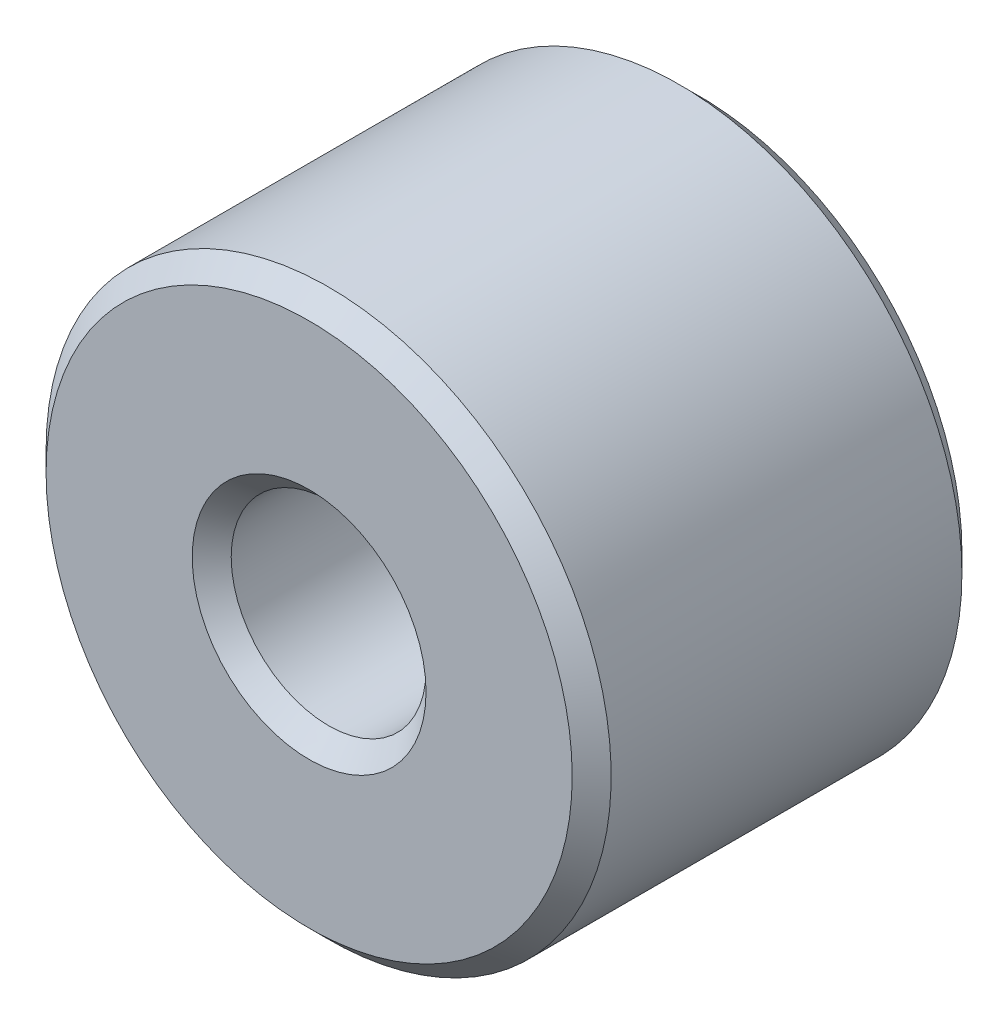
ISO-10303-21;
HEADER;
FILE_DESCRIPTION(('STEP AP214'),'2;1');
FILE_NAME('part.step','',(''),(''),'','','');
FILE_SCHEMA(('AUTOMOTIVE_DESIGN { 1 0 10303 214 1 1 1 1 }'));
ENDSEC;
DATA;
#1=APPLICATION_CONTEXT('core data for automotive mechanical design processes');
#2=APPLICATION_PROTOCOL_DEFINITION('international standard','automotive_design',2000,#1);
#3=PRODUCT_CONTEXT('',#1,'mechanical');
#4=PRODUCT('Part','Part','',(#3));
#5=PRODUCT_RELATED_PRODUCT_CATEGORY('part','',(#4));
#6=PRODUCT_DEFINITION_FORMATION('','',#4);
#7=PRODUCT_DEFINITION_CONTEXT('part definition',#1,'design');
#8=PRODUCT_DEFINITION('design','',#6,#7);
#9=PRODUCT_DEFINITION_SHAPE('','',#8);
#10=(LENGTH_UNIT() NAMED_UNIT(*) SI_UNIT(.MILLI.,.METRE.));
#11=(NAMED_UNIT(*) PLANE_ANGLE_UNIT() SI_UNIT($,.RADIAN.));
#12=(NAMED_UNIT(*) SI_UNIT($,.STERADIAN.) SOLID_ANGLE_UNIT());
#13=UNCERTAINTY_MEASURE_WITH_UNIT(LENGTH_MEASURE(1.E-05),#10,'distance_accuracy_value','');
#14=(GEOMETRIC_REPRESENTATION_CONTEXT(3) GLOBAL_UNCERTAINTY_ASSIGNED_CONTEXT((#13)) GLOBAL_UNIT_ASSIGNED_CONTEXT((#10,
#11,#12)) REPRESENTATION_CONTEXT('',''));
#15=CARTESIAN_POINT('',(0.,0.,0.));
#16=DIRECTION('',(0.,0.,1.));
#17=DIRECTION('',(1.,0.,0.));
#18=AXIS2_PLACEMENT_3D('',#15,#16,#17);
#19=CARTESIAN_POINT('',(0.,0.,10.));
#20=DIRECTION('',(0.,0.,-1.));
#21=DIRECTION('',(-1.,0.,0.));
#22=AXIS2_PLACEMENT_3D('',#19,#20,#21);
#23=CYLINDRICAL_SURFACE('',#22,2.5);
#24=CARTESIAN_POINT('',(0.,0.,0.499999999988177));
#25=DIRECTION('',(0.,0.,-1.));
#26=DIRECTION('',(-1.,0.,0.));
#27=AXIS2_PLACEMENT_3D('',#24,#25,#26);
#28=CIRCLE('',#27,2.49999999999773);
#29=CARTESIAN_POINT('',(-2.49999999999773,0.,0.499999999988177));
#30=VERTEX_POINT('',#29);
#31=EDGE_CURVE('E30',#30,#30,#28,.T.);
#32=ORIENTED_EDGE('',*,*,#31,.T.);
#33=EDGE_LOOP('',(#32));
#34=FACE_BOUND('',#33,.T.);
#35=CARTESIAN_POINT('',(0.,0.,9.50000000000273));
#36=DIRECTION('',(0.,0.,1.));
#37=DIRECTION('',(1.,0.,0.));
#38=AXIS2_PLACEMENT_3D('',#35,#36,#37);
#39=CIRCLE('',#38,2.49999999994088);
#40=CARTESIAN_POINT('',(2.49999999994088,0.,9.50000000000273));
#41=VERTEX_POINT('',#40);
#42=EDGE_CURVE('E33',#41,#41,#39,.T.);
#43=ORIENTED_EDGE('',*,*,#42,.T.);
#44=EDGE_LOOP('',(#43));
#45=FACE_BOUND('',#44,.T.);
#46=ADVANCED_FACE('F15',(#34,#45),#23,.F.);
#47=CARTESIAN_POINT('',(0.,0.,9.99999999999091));
#48=DIRECTION('',(0.,0.,1.));
#49=DIRECTION('',(1.,0.,0.));
#50=AXIS2_PLACEMENT_3D('',#47,#48,#49);
#51=CONICAL_SURFACE('',#50,2.9999999999859,0.785398163454292);
#52=ORIENTED_EDGE('',*,*,#42,.F.);
#53=EDGE_LOOP('',(#52));
#54=FACE_BOUND('',#53,.T.);
#55=CARTESIAN_POINT('',(0.,0.,9.99999999999091));
#56=DIRECTION('',(0.,0.,1.));
#57=DIRECTION('',(1.,0.,0.));
#58=AXIS2_PLACEMENT_3D('',#55,#56,#57);
#59=CIRCLE('',#58,2.9999999999859);
#60=CARTESIAN_POINT('',(2.9999999999859,0.,9.99999999999091));
#61=VERTEX_POINT('',#60);
#62=EDGE_CURVE('E18',#61,#61,#59,.F.);
#63=ORIENTED_EDGE('',*,*,#62,.F.);
#64=EDGE_LOOP('',(#63));
#65=FACE_BOUND('',#64,.T.);
#66=ADVANCED_FACE('F49',(#54,#65),#51,.F.);
#67=CARTESIAN_POINT('',(0.,0.,5.6843418860808E-11));
#68=DIRECTION('',(0.,0.,-1.));
#69=DIRECTION('',(-1.,0.,0.));
#70=AXIS2_PLACEMENT_3D('',#67,#68,#69);
#71=CONICAL_SURFACE('',#70,2.99999999992906,0.785398163397448);
#72=CARTESIAN_POINT('',(0.,0.,0.));
#73=DIRECTION('',(0.,0.,-1.));
#74=DIRECTION('',(-1.,0.,0.));
#75=AXIS2_PLACEMENT_3D('',#72,#73,#74);
#76=CIRCLE('',#75,2.9999999999859);
#77=CARTESIAN_POINT('',(-2.9999999999859,0.,0.));
#78=VERTEX_POINT('',#77);
#79=EDGE_CURVE('E40',#78,#78,#76,.T.);
#80=ORIENTED_EDGE('',*,*,#79,.T.);
#81=EDGE_LOOP('',(#80));
#82=FACE_BOUND('',#81,.T.);
#83=ORIENTED_EDGE('',*,*,#31,.F.);
#84=EDGE_LOOP('',(#83));
#85=FACE_BOUND('',#84,.T.);
#86=ADVANCED_FACE('F51',(#82,#85),#71,.F.);
#87=CARTESIAN_POINT('',(0.,0.,10.));
#88=DIRECTION('',(0.,0.,1.));
#89=DIRECTION('',(1.,0.,0.));
#90=AXIS2_PLACEMENT_3D('',#87,#88,#89);
#91=PLANE('',#90);
#92=CARTESIAN_POINT('',(0.,0.,9.99999999999091));
#93=DIRECTION('',(0.,0.,-1.));
#94=DIRECTION('',(-1.,0.,0.));
#95=AXIS2_PLACEMENT_3D('',#92,#93,#94);
#96=CIRCLE('',#95,6.75000000006776);
#97=CARTESIAN_POINT('',(-6.75000000006776,0.,9.99999999999091));
#98=VERTEX_POINT('',#97);
#99=EDGE_CURVE('E38',#98,#98,#96,.T.);
#100=ORIENTED_EDGE('',*,*,#99,.F.);
#101=EDGE_LOOP('',(#100));
#102=FACE_BOUND('',#101,.T.);
#103=ORIENTED_EDGE('',*,*,#62,.T.);
#104=EDGE_LOOP('',(#103));
#105=FACE_BOUND('',#104,.T.);
#106=ADVANCED_FACE('F47',(#102,#105),#91,.T.);
#107=CARTESIAN_POINT('',(0.,0.,0.));
#108=DIRECTION('',(0.,0.,1.));
#109=DIRECTION('',(1.,0.,0.));
#110=AXIS2_PLACEMENT_3D('',#107,#108,#109);
#111=PLANE('',#110);
#112=CARTESIAN_POINT('',(0.,0.,0.));
#113=DIRECTION('',(0.,0.,1.));
#114=DIRECTION('',(1.,0.,0.));
#115=AXIS2_PLACEMENT_3D('',#112,#113,#114);
#116=CIRCLE('',#115,6.75);
#117=CARTESIAN_POINT('',(6.75,0.,0.));
#118=VERTEX_POINT('',#117);
#119=EDGE_CURVE('E27',#118,#118,#116,.T.);
#120=ORIENTED_EDGE('',*,*,#119,.F.);
#121=EDGE_LOOP('',(#120));
#122=FACE_BOUND('',#121,.T.);
#123=ORIENTED_EDGE('',*,*,#79,.F.);
#124=EDGE_LOOP('',(#123));
#125=FACE_BOUND('',#124,.T.);
#126=ADVANCED_FACE('F75',(#122,#125),#111,.F.);
#127=CARTESIAN_POINT('',(0.,0.,9.50000000011642));
#128=DIRECTION('',(0.,0.,-1.));
#129=DIRECTION('',(-1.,0.,0.));
#130=AXIS2_PLACEMENT_3D('',#127,#128,#129);
#131=CONICAL_SURFACE('',#130,7.24999999994225,0.785398163397448);
#132=CARTESIAN_POINT('',(0.,0.,9.49999999999999));
#133=DIRECTION('',(0.,0.,-1.));
#134=DIRECTION('',(-1.,0.,0.));
#135=AXIS2_PLACEMENT_3D('',#132,#133,#134);
#136=CIRCLE('',#135,7.25);
#137=CARTESIAN_POINT('',(-7.25,0.,9.49999999999999));
#138=VERTEX_POINT('',#137);
#139=EDGE_CURVE('E22',#138,#138,#136,.T.);
#140=ORIENTED_EDGE('',*,*,#139,.F.);
#141=EDGE_LOOP('',(#140));
#142=FACE_BOUND('',#141,.T.);
#143=ORIENTED_EDGE('',*,*,#99,.T.);
#144=EDGE_LOOP('',(#143));
#145=FACE_BOUND('',#144,.T.);
#146=ADVANCED_FACE('F68',(#142,#145),#131,.T.);
#147=CARTESIAN_POINT('',(0.,0.,0.500000000000003));
#148=DIRECTION('',(0.,0.,1.));
#149=DIRECTION('',(1.,0.,0.));
#150=AXIS2_PLACEMENT_3D('',#147,#148,#149);
#151=CONICAL_SURFACE('',#150,7.25,0.78539816339745);
#152=CARTESIAN_POINT('',(0.,0.,0.500000000000002));
#153=DIRECTION('',(0.,0.,-1.));
#154=DIRECTION('',(-1.,0.,0.));
#155=AXIS2_PLACEMENT_3D('',#152,#153,#154);
#156=CIRCLE('',#155,7.25);
#157=CARTESIAN_POINT('',(-7.25,0.,0.500000000000002));
#158=VERTEX_POINT('',#157);
#159=EDGE_CURVE('E10',#158,#158,#156,.F.);
#160=ORIENTED_EDGE('',*,*,#159,.F.);
#161=EDGE_LOOP('',(#160));
#162=FACE_BOUND('',#161,.T.);
#163=ORIENTED_EDGE('',*,*,#119,.T.);
#164=EDGE_LOOP('',(#163));
#165=FACE_BOUND('',#164,.T.);
#166=ADVANCED_FACE('F63',(#162,#165),#151,.T.);
#167=CARTESIAN_POINT('',(0.,0.,10.));
#168=DIRECTION('',(0.,0.,-1.));
#169=DIRECTION('',(-1.,0.,0.));
#170=AXIS2_PLACEMENT_3D('',#167,#168,#169);
#171=CYLINDRICAL_SURFACE('',#170,7.25);
#172=ORIENTED_EDGE('',*,*,#159,.T.);
#173=EDGE_LOOP('',(#172));
#174=FACE_BOUND('',#173,.T.);
#175=ORIENTED_EDGE('',*,*,#139,.T.);
#176=EDGE_LOOP('',(#175));
#177=FACE_BOUND('',#176,.T.);
#178=ADVANCED_FACE('F61',(#174,#177),#171,.T.);
#179=CLOSED_SHELL('',(#46,#66,#86,#106,#126,#146,#166,#178));
#180=MANIFOLD_SOLID_BREP('B1',#179);
#181=ADVANCED_BREP_SHAPE_REPRESENTATION('',(#18,#180),#14);
#182=SHAPE_DEFINITION_REPRESENTATION(#9,#181);
ENDSEC;
END-ISO-10303-21;
